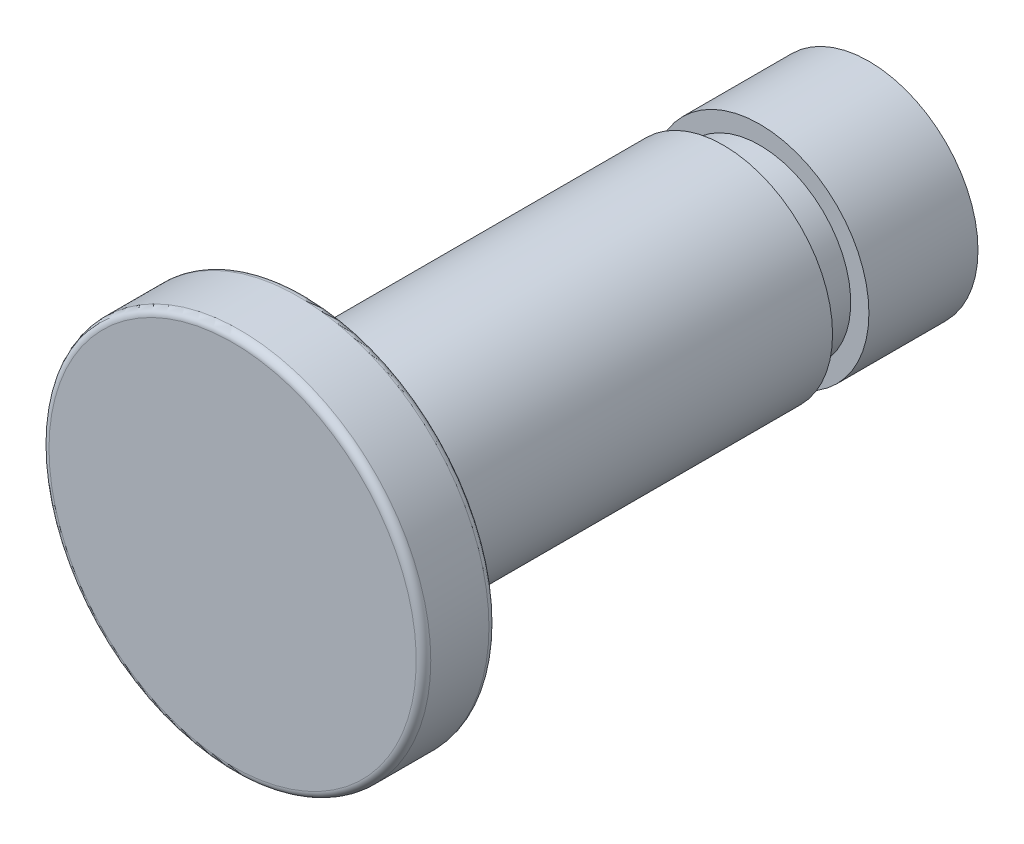
ISO-10303-21;
HEADER;
FILE_DESCRIPTION(('STEP AP214'),'2;1');
FILE_NAME('part.step','',(''),(''),'','','');
FILE_SCHEMA(('AUTOMOTIVE_DESIGN { 1 0 10303 214 1 1 1 1 }'));
ENDSEC;
DATA;
#1=APPLICATION_CONTEXT('core data for automotive mechanical design processes');
#2=APPLICATION_PROTOCOL_DEFINITION('international standard','automotive_design',2000,#1);
#3=PRODUCT_CONTEXT('',#1,'mechanical');
#4=PRODUCT('Part','Part','',(#3));
#5=PRODUCT_RELATED_PRODUCT_CATEGORY('part','',(#4));
#6=PRODUCT_DEFINITION_FORMATION('','',#4);
#7=PRODUCT_DEFINITION_CONTEXT('part definition',#1,'design');
#8=PRODUCT_DEFINITION('design','',#6,#7);
#9=PRODUCT_DEFINITION_SHAPE('','',#8);
#10=(LENGTH_UNIT() NAMED_UNIT(*) SI_UNIT(.MILLI.,.METRE.));
#11=(NAMED_UNIT(*) PLANE_ANGLE_UNIT() SI_UNIT($,.RADIAN.));
#12=(NAMED_UNIT(*) SI_UNIT($,.STERADIAN.) SOLID_ANGLE_UNIT());
#13=UNCERTAINTY_MEASURE_WITH_UNIT(LENGTH_MEASURE(1.E-05),#10,'distance_accuracy_value','');
#14=(GEOMETRIC_REPRESENTATION_CONTEXT(3) GLOBAL_UNCERTAINTY_ASSIGNED_CONTEXT((#13)) GLOBAL_UNIT_ASSIGNED_CONTEXT((#10,
#11,#12)) REPRESENTATION_CONTEXT('',''));
#15=CARTESIAN_POINT('',(0.,0.,0.));
#16=DIRECTION('',(0.,0.,1.));
#17=DIRECTION('',(1.,0.,0.));
#18=AXIS2_PLACEMENT_3D('',#15,#16,#17);
#19=CARTESIAN_POINT('',(3.,0.,0.));
#20=DIRECTION('',(0.,0.,-1.));
#21=DIRECTION('',(1.,0.,0.));
#22=AXIS2_PLACEMENT_3D('',#19,#20,#21);
#23=PLANE('',#22);
#24=CARTESIAN_POINT('',(3.,0.,0.));
#25=DIRECTION('',(0.,0.,-1.));
#26=DIRECTION('',(-1.,0.,0.));
#27=AXIS2_PLACEMENT_3D('',#24,#25,#26);
#28=CIRCLE('',#27,3.);
#29=CARTESIAN_POINT('',(0.,0.,0.));
#30=VERTEX_POINT('',#29);
#31=EDGE_CURVE('E53',#30,#30,#28,.T.);
#32=ORIENTED_EDGE('',*,*,#31,.T.);
#33=EDGE_LOOP('',(#32));
#34=FACE_BOUND('',#33,.T.);
#35=ADVANCED_FACE('F33',(#34),#23,.T.);
#36=CARTESIAN_POINT('',(3.,0.,17.5));
#37=DIRECTION('',(0.,0.,1.));
#38=DIRECTION('',(-1.,0.,0.));
#39=AXIS2_PLACEMENT_3D('',#36,#37,#38);
#40=CYLINDRICAL_SURFACE('',#39,3.);
#41=ORIENTED_EDGE('',*,*,#31,.F.);
#42=EDGE_LOOP('',(#41));
#43=FACE_BOUND('',#42,.T.);
#44=CARTESIAN_POINT('',(3.,0.,3.));
#45=DIRECTION('',(0.,0.,-1.));
#46=DIRECTION('',(-1.,0.,0.));
#47=AXIS2_PLACEMENT_3D('',#44,#45,#46);
#48=CIRCLE('',#47,3.);
#49=CARTESIAN_POINT('',(0.,0.,3.));
#50=VERTEX_POINT('',#49);
#51=EDGE_CURVE('E56',#50,#50,#48,.T.);
#52=ORIENTED_EDGE('',*,*,#51,.T.);
#53=EDGE_LOOP('',(#52));
#54=FACE_BOUND('',#53,.T.);
#55=ADVANCED_FACE('F90',(#43,#54),#40,.T.);
#56=CARTESIAN_POINT('',(0.5,0.,3.));
#57=DIRECTION('',(0.,0.,1.));
#58=DIRECTION('',(-1.,0.,0.));
#59=AXIS2_PLACEMENT_3D('',#56,#57,#58);
#60=PLANE('',#59);
#61=ORIENTED_EDGE('',*,*,#51,.F.);
#62=EDGE_LOOP('',(#61));
#63=FACE_BOUND('',#62,.T.);
#64=CARTESIAN_POINT('',(3.,0.,3.));
#65=DIRECTION('',(0.,0.,-1.));
#66=DIRECTION('',(-1.,0.,0.));
#67=AXIS2_PLACEMENT_3D('',#64,#65,#66);
#68=CIRCLE('',#67,2.5);
#69=CARTESIAN_POINT('',(0.5,0.,3.));
#70=VERTEX_POINT('',#69);
#71=EDGE_CURVE('E59',#70,#70,#68,.T.);
#72=ORIENTED_EDGE('',*,*,#71,.T.);
#73=EDGE_LOOP('',(#72));
#74=FACE_BOUND('',#73,.T.);
#75=ADVANCED_FACE('F96',(#63,#74),#60,.T.);
#76=CARTESIAN_POINT('',(3.,0.,17.5));
#77=DIRECTION('',(0.,0.,1.));
#78=DIRECTION('',(-1.,0.,0.));
#79=AXIS2_PLACEMENT_3D('',#76,#77,#78);
#80=CYLINDRICAL_SURFACE('',#79,2.5);
#81=ORIENTED_EDGE('',*,*,#71,.F.);
#82=EDGE_LOOP('',(#81));
#83=FACE_BOUND('',#82,.T.);
#84=CARTESIAN_POINT('',(3.,0.,4.));
#85=DIRECTION('',(0.,0.,-1.));
#86=DIRECTION('',(-1.,0.,0.));
#87=AXIS2_PLACEMENT_3D('',#84,#85,#86);
#88=CIRCLE('',#87,2.5);
#89=CARTESIAN_POINT('',(0.5,0.,4.));
#90=VERTEX_POINT('',#89);
#91=EDGE_CURVE('E62',#90,#90,#88,.T.);
#92=ORIENTED_EDGE('',*,*,#91,.T.);
#93=EDGE_LOOP('',(#92));
#94=FACE_BOUND('',#93,.T.);
#95=ADVANCED_FACE('F160',(#83,#94),#80,.T.);
#96=CARTESIAN_POINT('',(0.,0.,4.));
#97=DIRECTION('',(0.,0.,-1.));
#98=DIRECTION('',(1.,0.,0.));
#99=AXIS2_PLACEMENT_3D('',#96,#97,#98);
#100=PLANE('',#99);
#101=ORIENTED_EDGE('',*,*,#91,.F.);
#102=EDGE_LOOP('',(#101));
#103=FACE_BOUND('',#102,.T.);
#104=CARTESIAN_POINT('',(3.,0.,4.));
#105=DIRECTION('',(0.,0.,-1.));
#106=DIRECTION('',(-1.,0.,0.));
#107=AXIS2_PLACEMENT_3D('',#104,#105,#106);
#108=CIRCLE('',#107,3.);
#109=CARTESIAN_POINT('',(0.,0.,4.));
#110=VERTEX_POINT('',#109);
#111=EDGE_CURVE('E65',#110,#110,#108,.T.);
#112=ORIENTED_EDGE('',*,*,#111,.T.);
#113=EDGE_LOOP('',(#112));
#114=FACE_BOUND('',#113,.T.);
#115=ADVANCED_FACE('F86',(#103,#114),#100,.T.);
#116=CARTESIAN_POINT('',(3.,0.,17.5));
#117=DIRECTION('',(0.,0.,1.));
#118=DIRECTION('',(-1.,0.,0.));
#119=AXIS2_PLACEMENT_3D('',#116,#117,#118);
#120=CYLINDRICAL_SURFACE('',#119,3.);
#121=ORIENTED_EDGE('',*,*,#111,.F.);
#122=EDGE_LOOP('',(#121));
#123=FACE_BOUND('',#122,.T.);
#124=CARTESIAN_POINT('',(3.,0.,15.5));
#125=DIRECTION('',(0.,0.,-1.));
#126=DIRECTION('',(-1.,0.,0.));
#127=AXIS2_PLACEMENT_3D('',#124,#125,#126);
#128=CIRCLE('',#127,3.);
#129=CARTESIAN_POINT('',(0.,0.,15.5));
#130=VERTEX_POINT('',#129);
#131=EDGE_CURVE('E68',#130,#130,#128,.T.);
#132=ORIENTED_EDGE('',*,*,#131,.T.);
#133=EDGE_LOOP('',(#132));
#134=FACE_BOUND('',#133,.T.);
#135=ADVANCED_FACE('F72',(#123,#134),#120,.T.);
#136=CARTESIAN_POINT('',(0.,0.,15.5));
#137=DIRECTION('',(0.,0.,-1.));
#138=DIRECTION('',(1.,0.,0.));
#139=AXIS2_PLACEMENT_3D('',#136,#137,#138);
#140=PLANE('',#139);
#141=CARTESIAN_POINT('',(3.,0.,15.5));
#142=DIRECTION('',(0.,0.,1.));
#143=DIRECTION('',(1.,0.,0.));
#144=AXIS2_PLACEMENT_3D('',#141,#142,#143);
#145=CIRCLE('',#144,5.05);
#146=CARTESIAN_POINT('',(8.05,0.,15.5));
#147=VERTEX_POINT('',#146);
#148=EDGE_CURVE('E40',#147,#147,#145,.T.);
#149=ORIENTED_EDGE('',*,*,#148,.F.);
#150=EDGE_LOOP('',(#149));
#151=FACE_BOUND('',#150,.T.);
#152=ORIENTED_EDGE('',*,*,#131,.F.);
#153=EDGE_LOOP('',(#152));
#154=FACE_BOUND('',#153,.T.);
#155=ADVANCED_FACE('F74',(#151,#154),#140,.T.);
#156=CARTESIAN_POINT('',(3.,0.,17.5));
#157=DIRECTION('',(0.,0.,1.));
#158=DIRECTION('',(-1.,0.,0.));
#159=AXIS2_PLACEMENT_3D('',#156,#157,#158);
#160=CYLINDRICAL_SURFACE('',#159,5.25);
#161=CARTESIAN_POINT('',(3.,0.,15.7));
#162=DIRECTION('',(0.,0.,1.));
#163=DIRECTION('',(1.,0.,0.));
#164=AXIS2_PLACEMENT_3D('',#161,#162,#163);
#165=CIRCLE('',#164,5.25);
#166=CARTESIAN_POINT('',(8.25,0.,15.7));
#167=VERTEX_POINT('',#166);
#168=EDGE_CURVE('E44',#167,#167,#165,.F.);
#169=ORIENTED_EDGE('',*,*,#168,.F.);
#170=EDGE_LOOP('',(#169));
#171=FACE_BOUND('',#170,.T.);
#172=CARTESIAN_POINT('',(3.,0.,17.3));
#173=DIRECTION('',(0.,0.,-1.));
#174=DIRECTION('',(-1.,0.,0.));
#175=AXIS2_PLACEMENT_3D('',#172,#173,#174);
#176=CIRCLE('',#175,5.25);
#177=CARTESIAN_POINT('',(-2.25,0.,17.3));
#178=VERTEX_POINT('',#177);
#179=EDGE_CURVE('E48',#178,#178,#176,.F.);
#180=ORIENTED_EDGE('',*,*,#179,.F.);
#181=EDGE_LOOP('',(#180));
#182=FACE_BOUND('',#181,.T.);
#183=ADVANCED_FACE('F76',(#171,#182),#160,.T.);
#184=CARTESIAN_POINT('',(-2.25,0.,17.5));
#185=DIRECTION('',(0.,0.,1.));
#186=DIRECTION('',(-1.,0.,0.));
#187=AXIS2_PLACEMENT_3D('',#184,#185,#186);
#188=PLANE('',#187);
#189=CARTESIAN_POINT('',(3.,0.,17.5));
#190=DIRECTION('',(0.,0.,-1.));
#191=DIRECTION('',(-1.,0.,0.));
#192=AXIS2_PLACEMENT_3D('',#189,#190,#191);
#193=CIRCLE('',#192,5.05);
#194=CARTESIAN_POINT('',(-2.05,0.,17.5));
#195=VERTEX_POINT('',#194);
#196=EDGE_CURVE('E10',#195,#195,#193,.T.);
#197=ORIENTED_EDGE('',*,*,#196,.F.);
#198=EDGE_LOOP('',(#197));
#199=FACE_BOUND('',#198,.T.);
#200=ADVANCED_FACE('F83',(#199),#188,.T.);
#201=CARTESIAN_POINT('',(3.,0.,15.7));
#202=DIRECTION('',(0.,0.,-1.));
#203=DIRECTION('',(1.,0.,0.));
#204=AXIS2_PLACEMENT_3D('',#201,#202,#203);
#205=TOROIDAL_SURFACE('',#204,5.05,0.2);
#206=ORIENTED_EDGE('',*,*,#148,.T.);
#207=EDGE_LOOP('',(#206));
#208=FACE_BOUND('',#207,.T.);
#209=ORIENTED_EDGE('',*,*,#168,.T.);
#210=EDGE_LOOP('',(#209));
#211=FACE_BOUND('',#210,.T.);
#212=ADVANCED_FACE('F100',(#208,#211),#205,.T.);
#213=CARTESIAN_POINT('',(3.,0.,17.3));
#214=DIRECTION('',(0.,0.,1.));
#215=DIRECTION('',(-1.,0.,0.));
#216=AXIS2_PLACEMENT_3D('',#213,#214,#215);
#217=TOROIDAL_SURFACE('',#216,5.05,0.2);
#218=ORIENTED_EDGE('',*,*,#179,.T.);
#219=EDGE_LOOP('',(#218));
#220=FACE_BOUND('',#219,.T.);
#221=ORIENTED_EDGE('',*,*,#196,.T.);
#222=EDGE_LOOP('',(#221));
#223=FACE_BOUND('',#222,.T.);
#224=ADVANCED_FACE('F35',(#220,#223),#217,.T.);
#225=CLOSED_SHELL('',(#35,#55,#75,#95,#115,#135,#155,#183,#200,#212,#224));
#226=MANIFOLD_SOLID_BREP('B2',#225);
#227=ADVANCED_BREP_SHAPE_REPRESENTATION('',(#18,#226),#14);
#228=SHAPE_DEFINITION_REPRESENTATION(#9,#227);
ENDSEC;
END-ISO-10303-21;
